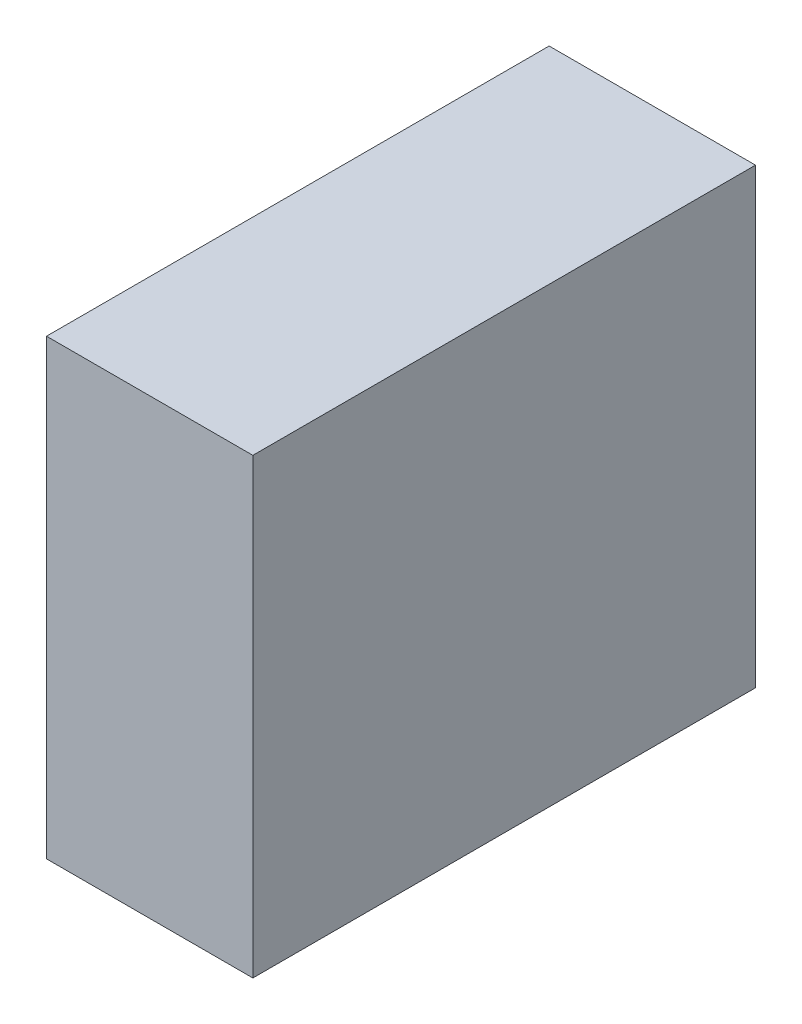
ISO-10303-21;
HEADER;
FILE_DESCRIPTION(('STEP AP214'),'2;1');
FILE_NAME('part.step','',(''),(''),'','','');
FILE_SCHEMA(('AUTOMOTIVE_DESIGN { 1 0 10303 214 1 1 1 1 }'));
ENDSEC;
DATA;
#1=APPLICATION_CONTEXT('core data for automotive mechanical design processes');
#2=APPLICATION_PROTOCOL_DEFINITION('international standard','automotive_design',2000,#1);
#3=PRODUCT_CONTEXT('',#1,'mechanical');
#4=PRODUCT('Part','Part','',(#3));
#5=PRODUCT_RELATED_PRODUCT_CATEGORY('part','',(#4));
#6=PRODUCT_DEFINITION_FORMATION('','',#4);
#7=PRODUCT_DEFINITION_CONTEXT('part definition',#1,'design');
#8=PRODUCT_DEFINITION('design','',#6,#7);
#9=PRODUCT_DEFINITION_SHAPE('','',#8);
#10=(LENGTH_UNIT() NAMED_UNIT(*) SI_UNIT(.MILLI.,.METRE.));
#11=(NAMED_UNIT(*) PLANE_ANGLE_UNIT() SI_UNIT($,.RADIAN.));
#12=(NAMED_UNIT(*) SI_UNIT($,.STERADIAN.) SOLID_ANGLE_UNIT());
#13=UNCERTAINTY_MEASURE_WITH_UNIT(LENGTH_MEASURE(1.E-05),#10,'distance_accuracy_value','');
#14=(GEOMETRIC_REPRESENTATION_CONTEXT(3) GLOBAL_UNCERTAINTY_ASSIGNED_CONTEXT((#13)) GLOBAL_UNIT_ASSIGNED_CONTEXT((#10,
#11,#12)) REPRESENTATION_CONTEXT('',''));
#15=CARTESIAN_POINT('',(0.,0.,0.));
#16=DIRECTION('',(0.,0.,1.));
#17=DIRECTION('',(1.,0.,0.));
#18=AXIS2_PLACEMENT_3D('',#15,#16,#17);
#19=CARTESIAN_POINT('',(38.2695703209719,1.49999995944139,23.435));
#20=DIRECTION('',(0.,-1.,0.));
#21=DIRECTION('',(0.,0.,-1.));
#22=AXIS2_PLACEMENT_3D('',#19,#20,#21);
#23=PLANE('',#22);
#24=DIRECTION('',(1.,0.,0.));
#25=VECTOR('',#24,1.);
#26=CARTESIAN_POINT('',(42.6021416337541,1.49999995944139,18.57));
#27=LINE('',#26,#25);
#28=CARTESIAN_POINT('',(34.0221416337541,1.49999995944138,18.57));
#29=VERTEX_POINT('',#28);
#30=CARTESIAN_POINT('',(42.6021416337541,1.49999995944139,18.57));
#31=VERTEX_POINT('',#30);
#32=EDGE_CURVE('E21',#29,#31,#27,.T.);
#33=ORIENTED_EDGE('',*,*,#32,.T.);
#34=DIRECTION('',(0.,0.,1.));
#35=VECTOR('',#34,1.);
#36=CARTESIAN_POINT('',(42.6021416337541,1.49999995944139,39.47));
#37=LINE('',#36,#35);
#38=CARTESIAN_POINT('',(42.6021416337541,1.49999995944139,39.47));
#39=VERTEX_POINT('',#38);
#40=EDGE_CURVE('E11',#31,#39,#37,.T.);
#41=ORIENTED_EDGE('',*,*,#40,.T.);
#42=DIRECTION('',(-1.,0.,0.));
#43=VECTOR('',#42,1.);
#44=CARTESIAN_POINT('',(21.301070816877,1.5,39.47));
#45=LINE('',#44,#43);
#46=CARTESIAN_POINT('',(34.0221416337541,1.49999995944139,39.47));
#47=VERTEX_POINT('',#46);
#48=EDGE_CURVE('E105',#39,#47,#45,.T.);
#49=ORIENTED_EDGE('',*,*,#48,.T.);
#50=DIRECTION('',(0.,0.,-1.));
#51=VECTOR('',#50,1.);
#52=CARTESIAN_POINT('',(34.0221416337541,1.5,19.735));
#53=LINE('',#52,#51);
#54=EDGE_CURVE('E71',#47,#29,#53,.T.);
#55=ORIENTED_EDGE('',*,*,#54,.T.);
#56=EDGE_LOOP('',(#33,#41,#49,#55));
#57=FACE_BOUND('',#56,.T.);
#58=ADVANCED_FACE('F17',(#57),#23,.T.);
#59=CARTESIAN_POINT('',(42.6021416337541,20.3220000107563,18.57));
#60=DIRECTION('',(1.,0.,0.));
#61=DIRECTION('',(0.,1.,0.));
#62=AXIS2_PLACEMENT_3D('',#59,#60,#61);
#63=PLANE('',#62);
#64=DIRECTION('',(0.,0.,-1.));
#65=VECTOR('',#64,1.);
#66=CARTESIAN_POINT('',(42.6021416337541,20.3220000107563,39.47));
#67=LINE('',#66,#65);
#68=CARTESIAN_POINT('',(42.6021416337541,20.3220000107563,39.47));
#69=VERTEX_POINT('',#68);
#70=CARTESIAN_POINT('',(42.6021416337541,20.3220000107563,18.57));
#71=VERTEX_POINT('',#70);
#72=EDGE_CURVE('E67',#69,#71,#67,.T.);
#73=ORIENTED_EDGE('',*,*,#72,.F.);
#74=DIRECTION('',(0.,-1.,0.));
#75=VECTOR('',#74,1.);
#76=CARTESIAN_POINT('',(42.6021416337541,20.3220000107563,39.47));
#77=LINE('',#76,#75);
#78=EDGE_CURVE('E95',#69,#39,#77,.T.);
#79=ORIENTED_EDGE('',*,*,#78,.T.);
#80=ORIENTED_EDGE('',*,*,#40,.F.);
#81=DIRECTION('',(0.,-1.,0.));
#82=VECTOR('',#81,1.);
#83=CARTESIAN_POINT('',(42.6021416337541,20.3220000107563,18.57));
#84=LINE('',#83,#82);
#85=EDGE_CURVE('E63',#71,#31,#84,.T.);
#86=ORIENTED_EDGE('',*,*,#85,.F.);
#87=EDGE_LOOP('',(#73,#79,#80,#86));
#88=FACE_BOUND('',#87,.T.);
#89=ADVANCED_FACE('F65',(#88),#63,.T.);
#90=CARTESIAN_POINT('',(34.0221416337541,20.3220000107563,18.57));
#91=DIRECTION('',(0.,0.,-1.));
#92=DIRECTION('',(0.,-1.,0.));
#93=AXIS2_PLACEMENT_3D('',#90,#91,#92);
#94=PLANE('',#93);
#95=DIRECTION('',(-1.,0.,0.));
#96=VECTOR('',#95,1.);
#97=CARTESIAN_POINT('',(42.6021416337541,20.3220000107563,18.57));
#98=LINE('',#97,#96);
#99=CARTESIAN_POINT('',(34.0221416337541,20.3220000107563,18.57));
#100=VERTEX_POINT('',#99);
#101=EDGE_CURVE('E74',#71,#100,#98,.T.);
#102=ORIENTED_EDGE('',*,*,#101,.F.);
#103=ORIENTED_EDGE('',*,*,#85,.T.);
#104=ORIENTED_EDGE('',*,*,#32,.F.);
#105=DIRECTION('',(0.,-1.,0.));
#106=VECTOR('',#105,1.);
#107=CARTESIAN_POINT('',(34.0221416337541,20.3220000107563,18.57));
#108=LINE('',#107,#106);
#109=EDGE_CURVE('E77',#100,#29,#108,.T.);
#110=ORIENTED_EDGE('',*,*,#109,.F.);
#111=EDGE_LOOP('',(#102,#103,#104,#110));
#112=FACE_BOUND('',#111,.T.);
#113=ADVANCED_FACE('F75',(#112),#94,.T.);
#114=CARTESIAN_POINT('',(34.0221416337541,20.3220000107563,39.47));
#115=DIRECTION('',(-1.,0.,0.));
#116=DIRECTION('',(0.,1.,0.));
#117=AXIS2_PLACEMENT_3D('',#114,#115,#116);
#118=PLANE('',#117);
#119=DIRECTION('',(0.,0.,1.));
#120=VECTOR('',#119,1.);
#121=CARTESIAN_POINT('',(34.0221416337541,20.3220000107563,18.57));
#122=LINE('',#121,#120);
#123=CARTESIAN_POINT('',(34.0221416337541,20.3220000107563,39.47));
#124=VERTEX_POINT('',#123);
#125=EDGE_CURVE('E82',#100,#124,#122,.T.);
#126=ORIENTED_EDGE('',*,*,#125,.F.);
#127=ORIENTED_EDGE('',*,*,#109,.T.);
#128=ORIENTED_EDGE('',*,*,#54,.F.);
#129=DIRECTION('',(0.,-1.,0.));
#130=VECTOR('',#129,1.);
#131=CARTESIAN_POINT('',(34.0221416337541,20.3220000107563,39.47));
#132=LINE('',#131,#130);
#133=EDGE_CURVE('E111',#124,#47,#132,.T.);
#134=ORIENTED_EDGE('',*,*,#133,.F.);
#135=EDGE_LOOP('',(#126,#127,#128,#134));
#136=FACE_BOUND('',#135,.T.);
#137=ADVANCED_FACE('F125',(#136),#118,.T.);
#138=CARTESIAN_POINT('',(42.6021416337541,20.3220000107563,39.47));
#139=DIRECTION('',(0.,0.,1.));
#140=DIRECTION('',(0.,-1.,0.));
#141=AXIS2_PLACEMENT_3D('',#138,#139,#140);
#142=PLANE('',#141);
#143=DIRECTION('',(1.,0.,0.));
#144=VECTOR('',#143,1.);
#145=CARTESIAN_POINT('',(34.0221416337541,20.3220000107563,39.47));
#146=LINE('',#145,#144);
#147=EDGE_CURVE('E85',#124,#69,#146,.T.);
#148=ORIENTED_EDGE('',*,*,#147,.F.);
#149=ORIENTED_EDGE('',*,*,#133,.T.);
#150=ORIENTED_EDGE('',*,*,#48,.F.);
#151=ORIENTED_EDGE('',*,*,#78,.F.);
#152=EDGE_LOOP('',(#148,#149,#150,#151));
#153=FACE_BOUND('',#152,.T.);
#154=ADVANCED_FACE('F19',(#153),#142,.T.);
#155=CARTESIAN_POINT('',(38.2695703209719,20.3220000107563,23.435));
#156=DIRECTION('',(0.,1.,0.));
#157=DIRECTION('',(1.,0.,0.));
#158=AXIS2_PLACEMENT_3D('',#155,#156,#157);
#159=PLANE('',#158);
#160=ORIENTED_EDGE('',*,*,#147,.T.);
#161=ORIENTED_EDGE('',*,*,#72,.T.);
#162=ORIENTED_EDGE('',*,*,#101,.T.);
#163=ORIENTED_EDGE('',*,*,#125,.T.);
#164=EDGE_LOOP('',(#160,#161,#162,#163));
#165=FACE_BOUND('',#164,.T.);
#166=ADVANCED_FACE('F83',(#165),#159,.T.);
#167=CLOSED_SHELL('',(#58,#89,#113,#137,#154,#166));
#168=MANIFOLD_SOLID_BREP('B1',#167);
#169=ADVANCED_BREP_SHAPE_REPRESENTATION('',(#18,#168),#14);
#170=SHAPE_DEFINITION_REPRESENTATION(#9,#169);
ENDSEC;
END-ISO-10303-21;
